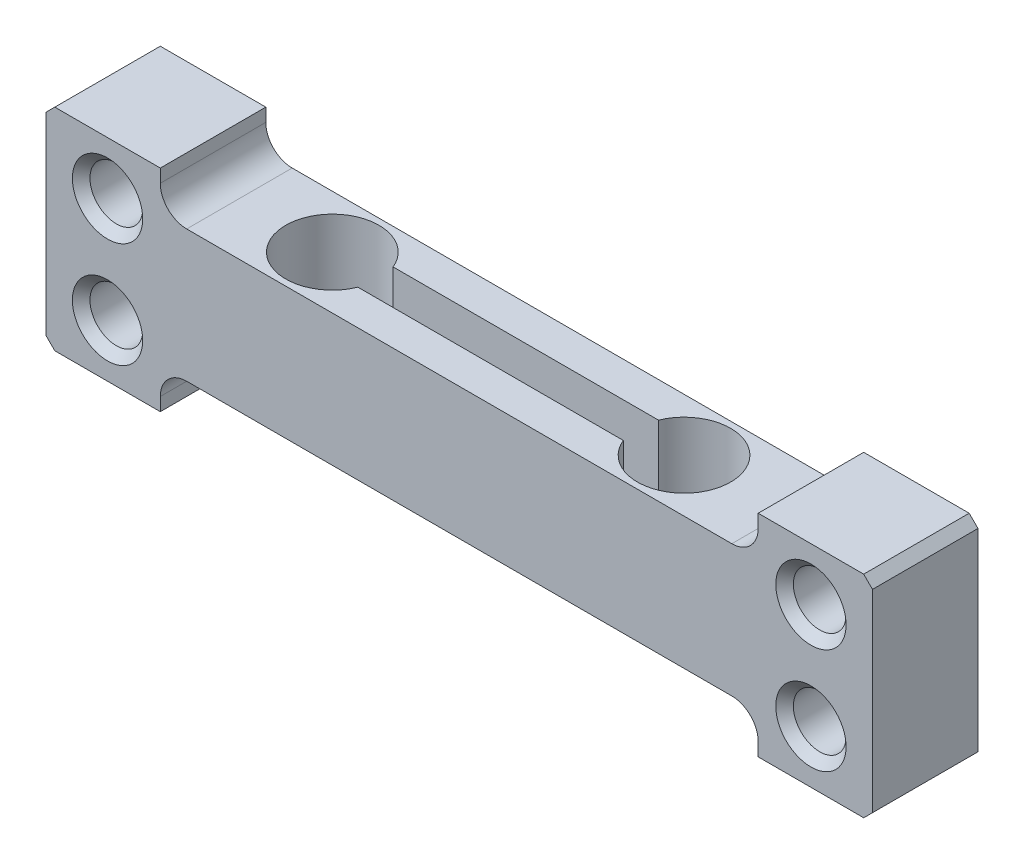
ISO-10303-21;
HEADER;
FILE_DESCRIPTION(('STEP AP214'),'2;1');
FILE_NAME('part.step','',(''),(''),'','','');
FILE_SCHEMA(('AUTOMOTIVE_DESIGN { 1 0 10303 214 1 1 1 1 }'));
ENDSEC;
DATA;
#1=APPLICATION_CONTEXT('core data for automotive mechanical design processes');
#2=APPLICATION_PROTOCOL_DEFINITION('international standard','automotive_design',2000,#1);
#3=PRODUCT_CONTEXT('',#1,'mechanical');
#4=PRODUCT('Part','Part','',(#3));
#5=PRODUCT_RELATED_PRODUCT_CATEGORY('part','',(#4));
#6=PRODUCT_DEFINITION_FORMATION('','',#4);
#7=PRODUCT_DEFINITION_CONTEXT('part definition',#1,'design');
#8=PRODUCT_DEFINITION('design','',#6,#7);
#9=PRODUCT_DEFINITION_SHAPE('','',#8);
#10=(LENGTH_UNIT() NAMED_UNIT(*) SI_UNIT(.MILLI.,.METRE.));
#11=(NAMED_UNIT(*) PLANE_ANGLE_UNIT() SI_UNIT($,.RADIAN.));
#12=(NAMED_UNIT(*) SI_UNIT($,.STERADIAN.) SOLID_ANGLE_UNIT());
#13=UNCERTAINTY_MEASURE_WITH_UNIT(LENGTH_MEASURE(1.E-05),#10,'distance_accuracy_value','');
#14=(GEOMETRIC_REPRESENTATION_CONTEXT(3) GLOBAL_UNCERTAINTY_ASSIGNED_CONTEXT((#13)) GLOBAL_UNIT_ASSIGNED_CONTEXT((#10,
#11,#12)) REPRESENTATION_CONTEXT('',''));
#15=CARTESIAN_POINT('',(0.,0.,0.));
#16=DIRECTION('',(0.,0.,1.));
#17=DIRECTION('',(1.,0.,0.));
#18=AXIS2_PLACEMENT_3D('',#15,#16,#17);
#19=CARTESIAN_POINT('',(8.,11.25,6.));
#20=DIRECTION('',(0.,0.,-1.));
#21=DIRECTION('',(-1.,0.,0.));
#22=AXIS2_PLACEMENT_3D('',#19,#20,#21);
#23=PLANE('',#22);
#24=CARTESIAN_POINT('',(3.5,3.,6.));
#25=DIRECTION('',(0.,0.,-1.));
#26=DIRECTION('',(-1.,0.,0.));
#27=AXIS2_PLACEMENT_3D('',#24,#25,#26);
#28=CIRCLE('',#27,2.00000000000001);
#29=CARTESIAN_POINT('',(1.49999999999999,3.,6.));
#30=VERTEX_POINT('',#29);
#31=EDGE_CURVE('E475',#30,#30,#28,.T.);
#32=ORIENTED_EDGE('',*,*,#31,.T.);
#33=EDGE_LOOP('',(#32));
#34=FACE_BOUND('',#33,.T.);
#35=CARTESIAN_POINT('',(3.5,9.,6.));
#36=DIRECTION('',(0.,0.,-1.));
#37=DIRECTION('',(-1.,0.,0.));
#38=AXIS2_PLACEMENT_3D('',#35,#36,#37);
#39=CIRCLE('',#38,2.00000000000001);
#40=CARTESIAN_POINT('',(1.49999999999999,9.,6.));
#41=VERTEX_POINT('',#40);
#42=EDGE_CURVE('E471',#41,#41,#39,.T.);
#43=ORIENTED_EDGE('',*,*,#42,.T.);
#44=EDGE_LOOP('',(#43));
#45=FACE_BOUND('',#44,.T.);
#46=CARTESIAN_POINT('',(43.5,9.,6.));
#47=DIRECTION('',(0.,0.,-1.));
#48=DIRECTION('',(-1.,0.,0.));
#49=AXIS2_PLACEMENT_3D('',#46,#47,#48);
#50=CIRCLE('',#49,2.00000000000001);
#51=CARTESIAN_POINT('',(41.5,9.,6.));
#52=VERTEX_POINT('',#51);
#53=EDGE_CURVE('E467',#52,#52,#50,.T.);
#54=ORIENTED_EDGE('',*,*,#53,.T.);
#55=EDGE_LOOP('',(#54));
#56=FACE_BOUND('',#55,.T.);
#57=CARTESIAN_POINT('',(43.5,3.,6.));
#58=DIRECTION('',(0.,0.,-1.));
#59=DIRECTION('',(-1.,0.,0.));
#60=AXIS2_PLACEMENT_3D('',#57,#58,#59);
#61=CIRCLE('',#60,2.00000000000001);
#62=CARTESIAN_POINT('',(41.5,3.,6.));
#63=VERTEX_POINT('',#62);
#64=EDGE_CURVE('E463',#63,#63,#61,.T.);
#65=ORIENTED_EDGE('',*,*,#64,.T.);
#66=EDGE_LOOP('',(#65));
#67=FACE_BOUND('',#66,.T.);
#68=DIRECTION('',(0.,-1.,0.));
#69=VECTOR('',#68,1.);
#70=CARTESIAN_POINT('',(0.,0.,6.));
#71=LINE('',#70,#69);
#72=CARTESIAN_POINT('',(0.,11.5,6.));
#73=VERTEX_POINT('',#72);
#74=CARTESIAN_POINT('',(0.,0.500000000000007,6.));
#75=VERTEX_POINT('',#74);
#76=EDGE_CURVE('E252',#73,#75,#71,.T.);
#77=ORIENTED_EDGE('',*,*,#76,.T.);
#78=DIRECTION('',(-0.707106781186548,0.707106781186548,0.));
#79=VECTOR('',#78,1.);
#80=CARTESIAN_POINT('',(0.500000000000007,0.,6.));
#81=LINE('',#80,#79);
#82=CARTESIAN_POINT('',(0.500000000000007,0.,6.));
#83=VERTEX_POINT('',#82);
#84=EDGE_CURVE('E435',#75,#83,#81,.F.);
#85=ORIENTED_EDGE('',*,*,#84,.T.);
#86=DIRECTION('',(1.,0.,0.));
#87=VECTOR('',#86,1.);
#88=CARTESIAN_POINT('',(0.,0.,6.));
#89=LINE('',#88,#87);
#90=CARTESIAN_POINT('',(6.5,0.,6.));
#91=VERTEX_POINT('',#90);
#92=EDGE_CURVE('E256',#83,#91,#89,.T.);
#93=ORIENTED_EDGE('',*,*,#92,.T.);
#94=DIRECTION('',(0.,1.,0.));
#95=VECTOR('',#94,1.);
#96=CARTESIAN_POINT('',(6.5,0.,6.));
#97=LINE('',#96,#95);
#98=CARTESIAN_POINT('',(6.5,0.749999999999989,6.));
#99=VERTEX_POINT('',#98);
#100=EDGE_CURVE('E260',#91,#99,#97,.T.);
#101=ORIENTED_EDGE('',*,*,#100,.T.);
#102=CARTESIAN_POINT('',(8.,0.75,6.));
#103=DIRECTION('',(0.,0.,-1.));
#104=DIRECTION('',(-1.,0.,0.));
#105=AXIS2_PLACEMENT_3D('',#102,#103,#104);
#106=CIRCLE('',#105,1.5);
#107=CARTESIAN_POINT('',(8.00000000000001,2.25,6.));
#108=VERTEX_POINT('',#107);
#109=EDGE_CURVE('E263',#99,#108,#106,.T.);
#110=ORIENTED_EDGE('',*,*,#109,.T.);
#111=DIRECTION('',(1.,0.,0.));
#112=VECTOR('',#111,1.);
#113=CARTESIAN_POINT('',(8.00000000000001,2.25,6.));
#114=LINE('',#113,#112);
#115=CARTESIAN_POINT('',(39.,2.25,6.));
#116=VERTEX_POINT('',#115);
#117=EDGE_CURVE('E266',#108,#116,#114,.T.);
#118=ORIENTED_EDGE('',*,*,#117,.T.);
#119=CARTESIAN_POINT('',(39.,0.75,6.));
#120=DIRECTION('',(0.,0.,-1.));
#121=DIRECTION('',(1.,0.,0.));
#122=AXIS2_PLACEMENT_3D('',#119,#120,#121);
#123=CIRCLE('',#122,1.5);
#124=CARTESIAN_POINT('',(40.5,0.749999999999989,6.));
#125=VERTEX_POINT('',#124);
#126=EDGE_CURVE('E269',#116,#125,#123,.T.);
#127=ORIENTED_EDGE('',*,*,#126,.T.);
#128=DIRECTION('',(0.,-1.,0.));
#129=VECTOR('',#128,1.);
#130=CARTESIAN_POINT('',(40.5,0.,6.));
#131=LINE('',#130,#129);
#132=CARTESIAN_POINT('',(40.5,0.,6.));
#133=VERTEX_POINT('',#132);
#134=EDGE_CURVE('E272',#125,#133,#131,.T.);
#135=ORIENTED_EDGE('',*,*,#134,.T.);
#136=DIRECTION('',(1.,0.,0.));
#137=VECTOR('',#136,1.);
#138=CARTESIAN_POINT('',(40.5,0.,6.));
#139=LINE('',#138,#137);
#140=CARTESIAN_POINT('',(46.5,0.,6.));
#141=VERTEX_POINT('',#140);
#142=EDGE_CURVE('E275',#133,#141,#139,.T.);
#143=ORIENTED_EDGE('',*,*,#142,.T.);
#144=DIRECTION('',(-0.707106781186548,-0.707106781186548,0.));
#145=VECTOR('',#144,1.);
#146=CARTESIAN_POINT('',(47.,0.500000000000007,6.));
#147=LINE('',#146,#145);
#148=CARTESIAN_POINT('',(47.,0.500000000000007,6.));
#149=VERTEX_POINT('',#148);
#150=EDGE_CURVE('E429',#141,#149,#147,.F.);
#151=ORIENTED_EDGE('',*,*,#150,.T.);
#152=DIRECTION('',(0.,1.,0.));
#153=VECTOR('',#152,1.);
#154=CARTESIAN_POINT('',(47.,0.,6.));
#155=LINE('',#154,#153);
#156=CARTESIAN_POINT('',(47.,11.5,6.));
#157=VERTEX_POINT('',#156);
#158=EDGE_CURVE('E279',#149,#157,#155,.T.);
#159=ORIENTED_EDGE('',*,*,#158,.T.);
#160=DIRECTION('',(0.707106781186552,-0.707106781186543,0.));
#161=VECTOR('',#160,1.);
#162=CARTESIAN_POINT('',(46.5,12.,6.));
#163=LINE('',#162,#161);
#164=CARTESIAN_POINT('',(46.5,12.,6.));
#165=VERTEX_POINT('',#164);
#166=EDGE_CURVE('E426',#157,#165,#163,.F.);
#167=ORIENTED_EDGE('',*,*,#166,.T.);
#168=DIRECTION('',(-1.,0.,0.));
#169=VECTOR('',#168,1.);
#170=CARTESIAN_POINT('',(40.5,12.,6.));
#171=LINE('',#170,#169);
#172=CARTESIAN_POINT('',(40.5,12.,6.));
#173=VERTEX_POINT('',#172);
#174=EDGE_CURVE('E283',#165,#173,#171,.T.);
#175=ORIENTED_EDGE('',*,*,#174,.T.);
#176=DIRECTION('',(0.,-1.,0.));
#177=VECTOR('',#176,1.);
#178=CARTESIAN_POINT('',(40.5,11.25,6.));
#179=LINE('',#178,#177);
#180=CARTESIAN_POINT('',(40.5,11.25,6.));
#181=VERTEX_POINT('',#180);
#182=EDGE_CURVE('E286',#173,#181,#179,.T.);
#183=ORIENTED_EDGE('',*,*,#182,.T.);
#184=CARTESIAN_POINT('',(39.,11.25,6.));
#185=DIRECTION('',(0.,0.,-1.));
#186=DIRECTION('',(-1.,0.,0.));
#187=AXIS2_PLACEMENT_3D('',#184,#185,#186);
#188=CIRCLE('',#187,1.5);
#189=CARTESIAN_POINT('',(39.,9.75,6.));
#190=VERTEX_POINT('',#189);
#191=EDGE_CURVE('E289',#181,#190,#188,.T.);
#192=ORIENTED_EDGE('',*,*,#191,.T.);
#193=DIRECTION('',(-1.,0.,0.));
#194=VECTOR('',#193,1.);
#195=CARTESIAN_POINT('',(8.00000000000001,9.75,6.));
#196=LINE('',#195,#194);
#197=CARTESIAN_POINT('',(8.00000000000001,9.75,6.));
#198=VERTEX_POINT('',#197);
#199=EDGE_CURVE('E292',#190,#198,#196,.T.);
#200=ORIENTED_EDGE('',*,*,#199,.T.);
#201=CARTESIAN_POINT('',(8.,11.25,6.));
#202=DIRECTION('',(0.,0.,-1.));
#203=DIRECTION('',(-1.,0.,0.));
#204=AXIS2_PLACEMENT_3D('',#201,#202,#203);
#205=CIRCLE('',#204,1.5);
#206=CARTESIAN_POINT('',(6.5,11.25,6.));
#207=VERTEX_POINT('',#206);
#208=EDGE_CURVE('E295',#198,#207,#205,.T.);
#209=ORIENTED_EDGE('',*,*,#208,.T.);
#210=DIRECTION('',(0.,1.,0.));
#211=VECTOR('',#210,1.);
#212=CARTESIAN_POINT('',(6.5,11.25,6.));
#213=LINE('',#212,#211);
#214=CARTESIAN_POINT('',(6.5,12.,6.));
#215=VERTEX_POINT('',#214);
#216=EDGE_CURVE('E298',#207,#215,#213,.T.);
#217=ORIENTED_EDGE('',*,*,#216,.T.);
#218=DIRECTION('',(-1.,0.,0.));
#219=VECTOR('',#218,1.);
#220=CARTESIAN_POINT('',(0.,12.,6.));
#221=LINE('',#220,#219);
#222=CARTESIAN_POINT('',(0.500000000000014,12.,6.));
#223=VERTEX_POINT('',#222);
#224=EDGE_CURVE('E301',#215,#223,#221,.T.);
#225=ORIENTED_EDGE('',*,*,#224,.T.);
#226=DIRECTION('',(0.707106781186548,0.707106781186548,0.));
#227=VECTOR('',#226,1.);
#228=CARTESIAN_POINT('',(0.,11.5,6.));
#229=LINE('',#228,#227);
#230=EDGE_CURVE('E432',#223,#73,#229,.F.);
#231=ORIENTED_EDGE('',*,*,#230,.T.);
#232=EDGE_LOOP('',(#77,#85,#93,#101,#110,#118,#127,#135,#143,#151,#159,#167,#175,#183,#192,#200,
#209,#217,#225,#231));
#233=FACE_BOUND('',#232,.T.);
#234=ADVANCED_FACE('F41',(#34,#45,#56,#67,#233),#23,.F.);
#235=CARTESIAN_POINT('',(8.,11.25,0.));
#236=DIRECTION('',(0.,0.,-1.));
#237=DIRECTION('',(-1.,0.,0.));
#238=AXIS2_PLACEMENT_3D('',#235,#236,#237);
#239=PLANE('',#238);
#240=CARTESIAN_POINT('',(3.5,3.,0.));
#241=DIRECTION('',(0.,0.,-1.));
#242=DIRECTION('',(-1.,0.,0.));
#243=AXIS2_PLACEMENT_3D('',#240,#241,#242);
#244=CIRCLE('',#243,2.00000000000002);
#245=CARTESIAN_POINT('',(1.49999999999998,3.,0.));
#246=VERTEX_POINT('',#245);
#247=EDGE_CURVE('E499',#246,#246,#244,.F.);
#248=ORIENTED_EDGE('',*,*,#247,.T.);
#249=EDGE_LOOP('',(#248));
#250=FACE_BOUND('',#249,.T.);
#251=CARTESIAN_POINT('',(3.5,9.,0.));
#252=DIRECTION('',(0.,0.,-1.));
#253=DIRECTION('',(-1.,0.,0.));
#254=AXIS2_PLACEMENT_3D('',#251,#252,#253);
#255=CIRCLE('',#254,2.00000000000002);
#256=CARTESIAN_POINT('',(1.49999999999998,9.,0.));
#257=VERTEX_POINT('',#256);
#258=EDGE_CURVE('E495',#257,#257,#255,.F.);
#259=ORIENTED_EDGE('',*,*,#258,.T.);
#260=EDGE_LOOP('',(#259));
#261=FACE_BOUND('',#260,.T.);
#262=CARTESIAN_POINT('',(43.5,3.,0.));
#263=DIRECTION('',(0.,0.,-1.));
#264=DIRECTION('',(-1.,0.,0.));
#265=AXIS2_PLACEMENT_3D('',#262,#263,#264);
#266=CIRCLE('',#265,2.);
#267=CARTESIAN_POINT('',(41.5,3.,0.));
#268=VERTEX_POINT('',#267);
#269=EDGE_CURVE('E491',#268,#268,#266,.F.);
#270=ORIENTED_EDGE('',*,*,#269,.T.);
#271=EDGE_LOOP('',(#270));
#272=FACE_BOUND('',#271,.T.);
#273=CARTESIAN_POINT('',(43.5,9.,0.));
#274=DIRECTION('',(0.,0.,-1.));
#275=DIRECTION('',(-1.,0.,0.));
#276=AXIS2_PLACEMENT_3D('',#273,#274,#275);
#277=CIRCLE('',#276,2.);
#278=CARTESIAN_POINT('',(41.5,9.,0.));
#279=VERTEX_POINT('',#278);
#280=EDGE_CURVE('E487',#279,#279,#277,.F.);
#281=ORIENTED_EDGE('',*,*,#280,.T.);
#282=EDGE_LOOP('',(#281));
#283=FACE_BOUND('',#282,.T.);
#284=DIRECTION('',(1.,0.,0.));
#285=VECTOR('',#284,1.);
#286=CARTESIAN_POINT('',(0.,0.,0.));
#287=LINE('',#286,#285);
#288=CARTESIAN_POINT('',(0.500000000000007,0.,0.));
#289=VERTEX_POINT('',#288);
#290=CARTESIAN_POINT('',(6.5,0.,0.));
#291=VERTEX_POINT('',#290);
#292=EDGE_CURVE('E309',#289,#291,#287,.T.);
#293=ORIENTED_EDGE('',*,*,#292,.F.);
#294=DIRECTION('',(0.707106781186548,-0.707106781186548,0.));
#295=VECTOR('',#294,1.);
#296=CARTESIAN_POINT('',(-1.375,1.875,0.));
#297=LINE('',#296,#295);
#298=CARTESIAN_POINT('',(0.,0.500000000000007,0.));
#299=VERTEX_POINT('',#298);
#300=EDGE_CURVE('E416',#289,#299,#297,.F.);
#301=ORIENTED_EDGE('',*,*,#300,.T.);
#302=DIRECTION('',(0.,-1.,0.));
#303=VECTOR('',#302,1.);
#304=CARTESIAN_POINT('',(0.,0.,0.));
#305=LINE('',#304,#303);
#306=CARTESIAN_POINT('',(0.,11.5,0.));
#307=VERTEX_POINT('',#306);
#308=EDGE_CURVE('E251',#307,#299,#305,.T.);
#309=ORIENTED_EDGE('',*,*,#308,.F.);
#310=DIRECTION('',(-0.707106781186548,-0.707106781186548,0.));
#311=VECTOR('',#310,1.);
#312=CARTESIAN_POINT('',(3.87500000000001,15.375,0.));
#313=LINE('',#312,#311);
#314=CARTESIAN_POINT('',(0.500000000000014,12.,0.));
#315=VERTEX_POINT('',#314);
#316=EDGE_CURVE('E413',#307,#315,#313,.F.);
#317=ORIENTED_EDGE('',*,*,#316,.T.);
#318=DIRECTION('',(-1.,0.,0.));
#319=VECTOR('',#318,1.);
#320=CARTESIAN_POINT('',(0.,12.,0.));
#321=LINE('',#320,#319);
#322=CARTESIAN_POINT('',(6.5,12.,0.));
#323=VERTEX_POINT('',#322);
#324=EDGE_CURVE('E257',#323,#315,#321,.T.);
#325=ORIENTED_EDGE('',*,*,#324,.F.);
#326=DIRECTION('',(0.,1.,0.));
#327=VECTOR('',#326,1.);
#328=CARTESIAN_POINT('',(6.5,11.25,0.));
#329=LINE('',#328,#327);
#330=CARTESIAN_POINT('',(6.5,11.25,0.));
#331=VERTEX_POINT('',#330);
#332=EDGE_CURVE('E350',#331,#323,#329,.T.);
#333=ORIENTED_EDGE('',*,*,#332,.F.);
#334=CARTESIAN_POINT('',(8.,11.25,0.));
#335=DIRECTION('',(0.,0.,-1.));
#336=DIRECTION('',(-1.,0.,0.));
#337=AXIS2_PLACEMENT_3D('',#334,#335,#336);
#338=CIRCLE('',#337,1.5);
#339=CARTESIAN_POINT('',(8.00000000000001,9.75,0.));
#340=VERTEX_POINT('',#339);
#341=EDGE_CURVE('E347',#340,#331,#338,.T.);
#342=ORIENTED_EDGE('',*,*,#341,.F.);
#343=DIRECTION('',(-1.,0.,0.));
#344=VECTOR('',#343,1.);
#345=CARTESIAN_POINT('',(8.00000000000001,9.75,0.));
#346=LINE('',#345,#344);
#347=CARTESIAN_POINT('',(39.,9.75,0.));
#348=VERTEX_POINT('',#347);
#349=EDGE_CURVE('E344',#348,#340,#346,.T.);
#350=ORIENTED_EDGE('',*,*,#349,.F.);
#351=CARTESIAN_POINT('',(39.,11.25,0.));
#352=DIRECTION('',(0.,0.,-1.));
#353=DIRECTION('',(-1.,0.,0.));
#354=AXIS2_PLACEMENT_3D('',#351,#352,#353);
#355=CIRCLE('',#354,1.5);
#356=CARTESIAN_POINT('',(40.5,11.25,0.));
#357=VERTEX_POINT('',#356);
#358=EDGE_CURVE('E341',#357,#348,#355,.T.);
#359=ORIENTED_EDGE('',*,*,#358,.F.);
#360=DIRECTION('',(0.,-1.,0.));
#361=VECTOR('',#360,1.);
#362=CARTESIAN_POINT('',(40.5,11.25,0.));
#363=LINE('',#362,#361);
#364=CARTESIAN_POINT('',(40.5,12.,0.));
#365=VERTEX_POINT('',#364);
#366=EDGE_CURVE('E338',#365,#357,#363,.T.);
#367=ORIENTED_EDGE('',*,*,#366,.F.);
#368=DIRECTION('',(-1.,0.,0.));
#369=VECTOR('',#368,1.);
#370=CARTESIAN_POINT('',(40.5,12.,0.));
#371=LINE('',#370,#369);
#372=CARTESIAN_POINT('',(46.5,12.,0.));
#373=VERTEX_POINT('',#372);
#374=EDGE_CURVE('E335',#373,#365,#371,.T.);
#375=ORIENTED_EDGE('',*,*,#374,.F.);
#376=DIRECTION('',(-0.707106781186552,0.707106781186543,0.));
#377=VECTOR('',#376,1.);
#378=CARTESIAN_POINT('',(27.6249999999997,30.875,0.));
#379=LINE('',#378,#377);
#380=CARTESIAN_POINT('',(47.,11.5,0.));
#381=VERTEX_POINT('',#380);
#382=EDGE_CURVE('E407',#373,#381,#379,.F.);
#383=ORIENTED_EDGE('',*,*,#382,.T.);
#384=DIRECTION('',(0.,1.,0.));
#385=VECTOR('',#384,1.);
#386=CARTESIAN_POINT('',(47.,0.,0.));
#387=LINE('',#386,#385);
#388=CARTESIAN_POINT('',(47.,0.500000000000007,0.));
#389=VERTEX_POINT('',#388);
#390=EDGE_CURVE('E331',#389,#381,#387,.T.);
#391=ORIENTED_EDGE('',*,*,#390,.F.);
#392=DIRECTION('',(0.707106781186548,0.707106781186548,0.));
#393=VECTOR('',#392,1.);
#394=CARTESIAN_POINT('',(32.875,-13.625,0.));
#395=LINE('',#394,#393);
#396=CARTESIAN_POINT('',(46.5,0.,0.));
#397=VERTEX_POINT('',#396);
#398=EDGE_CURVE('E410',#389,#397,#395,.F.);
#399=ORIENTED_EDGE('',*,*,#398,.T.);
#400=DIRECTION('',(1.,0.,0.));
#401=VECTOR('',#400,1.);
#402=CARTESIAN_POINT('',(40.5,0.,0.));
#403=LINE('',#402,#401);
#404=CARTESIAN_POINT('',(40.5,0.,0.));
#405=VERTEX_POINT('',#404);
#406=EDGE_CURVE('E327',#405,#397,#403,.T.);
#407=ORIENTED_EDGE('',*,*,#406,.F.);
#408=DIRECTION('',(0.,-1.,0.));
#409=VECTOR('',#408,1.);
#410=CARTESIAN_POINT('',(40.5,0.,0.));
#411=LINE('',#410,#409);
#412=CARTESIAN_POINT('',(40.5,0.749999999999989,0.));
#413=VERTEX_POINT('',#412);
#414=EDGE_CURVE('E324',#413,#405,#411,.T.);
#415=ORIENTED_EDGE('',*,*,#414,.F.);
#416=CARTESIAN_POINT('',(39.,0.75,0.));
#417=DIRECTION('',(0.,0.,-1.));
#418=DIRECTION('',(1.,0.,0.));
#419=AXIS2_PLACEMENT_3D('',#416,#417,#418);
#420=CIRCLE('',#419,1.5);
#421=CARTESIAN_POINT('',(39.,2.25,0.));
#422=VERTEX_POINT('',#421);
#423=EDGE_CURVE('E321',#422,#413,#420,.T.);
#424=ORIENTED_EDGE('',*,*,#423,.F.);
#425=DIRECTION('',(1.,0.,0.));
#426=VECTOR('',#425,1.);
#427=CARTESIAN_POINT('',(8.00000000000001,2.25,0.));
#428=LINE('',#427,#426);
#429=CARTESIAN_POINT('',(8.00000000000001,2.25,0.));
#430=VERTEX_POINT('',#429);
#431=EDGE_CURVE('E318',#430,#422,#428,.T.);
#432=ORIENTED_EDGE('',*,*,#431,.F.);
#433=CARTESIAN_POINT('',(8.,0.75,0.));
#434=DIRECTION('',(0.,0.,-1.));
#435=DIRECTION('',(-1.,0.,0.));
#436=AXIS2_PLACEMENT_3D('',#433,#434,#435);
#437=CIRCLE('',#436,1.5);
#438=CARTESIAN_POINT('',(6.5,0.749999999999989,0.));
#439=VERTEX_POINT('',#438);
#440=EDGE_CURVE('E315',#439,#430,#437,.T.);
#441=ORIENTED_EDGE('',*,*,#440,.F.);
#442=DIRECTION('',(0.,1.,0.));
#443=VECTOR('',#442,1.);
#444=CARTESIAN_POINT('',(6.5,0.,0.));
#445=LINE('',#444,#443);
#446=EDGE_CURVE('E312',#291,#439,#445,.T.);
#447=ORIENTED_EDGE('',*,*,#446,.F.);
#448=EDGE_LOOP('',(#293,#301,#309,#317,#325,#333,#342,#350,#359,#367,#375,#383,#391,#399,#407,
#415,#424,#432,#441,#447));
#449=FACE_BOUND('',#448,.T.);
#450=ADVANCED_FACE('F530',(#250,#261,#272,#283,#449),#239,.T.);
#451=CARTESIAN_POINT('',(0.,0.,6.));
#452=DIRECTION('',(1.,0.,0.));
#453=DIRECTION('',(0.,0.,-1.));
#454=AXIS2_PLACEMENT_3D('',#451,#452,#453);
#455=PLANE('',#454);
#456=ORIENTED_EDGE('',*,*,#308,.T.);
#457=DIRECTION('',(0.,0.,1.));
#458=VECTOR('',#457,1.);
#459=CARTESIAN_POINT('',(0.,0.500000000000007,6.));
#460=LINE('',#459,#458);
#461=EDGE_CURVE('E423',#299,#75,#460,.T.);
#462=ORIENTED_EDGE('',*,*,#461,.T.);
#463=ORIENTED_EDGE('',*,*,#76,.F.);
#464=DIRECTION('',(0.,0.,-1.));
#465=VECTOR('',#464,1.);
#466=CARTESIAN_POINT('',(0.,11.5,6.));
#467=LINE('',#466,#465);
#468=EDGE_CURVE('E419',#73,#307,#467,.T.);
#469=ORIENTED_EDGE('',*,*,#468,.T.);
#470=EDGE_LOOP('',(#456,#462,#463,#469));
#471=FACE_BOUND('',#470,.T.);
#472=ADVANCED_FACE('F536',(#471),#455,.F.);
#473=CARTESIAN_POINT('',(0.,0.,6.));
#474=DIRECTION('',(0.,1.,0.));
#475=DIRECTION('',(0.,0.,1.));
#476=AXIS2_PLACEMENT_3D('',#473,#474,#475);
#477=PLANE('',#476);
#478=ORIENTED_EDGE('',*,*,#92,.F.);
#479=DIRECTION('',(0.,0.,-1.));
#480=VECTOR('',#479,1.);
#481=CARTESIAN_POINT('',(0.500000000000007,0.,6.));
#482=LINE('',#481,#480);
#483=EDGE_CURVE('E403',#83,#289,#482,.T.);
#484=ORIENTED_EDGE('',*,*,#483,.T.);
#485=ORIENTED_EDGE('',*,*,#292,.T.);
#486=DIRECTION('',(0.,0.,-1.));
#487=VECTOR('',#486,1.);
#488=CARTESIAN_POINT('',(6.5,0.,6.));
#489=LINE('',#488,#487);
#490=EDGE_CURVE('E399',#91,#291,#489,.T.);
#491=ORIENTED_EDGE('',*,*,#490,.F.);
#492=EDGE_LOOP('',(#478,#484,#485,#491));
#493=FACE_BOUND('',#492,.T.);
#494=ADVANCED_FACE('F597',(#493),#477,.F.);
#495=CARTESIAN_POINT('',(6.5,0.,6.));
#496=DIRECTION('',(-1.,0.,0.));
#497=DIRECTION('',(0.,0.,1.));
#498=AXIS2_PLACEMENT_3D('',#495,#496,#497);
#499=PLANE('',#498);
#500=ORIENTED_EDGE('',*,*,#446,.T.);
#501=DIRECTION('',(0.,0.,-1.));
#502=VECTOR('',#501,1.);
#503=CARTESIAN_POINT('',(6.5,0.749999999999989,6.));
#504=LINE('',#503,#502);
#505=EDGE_CURVE('E395',#99,#439,#504,.T.);
#506=ORIENTED_EDGE('',*,*,#505,.F.);
#507=ORIENTED_EDGE('',*,*,#100,.F.);
#508=ORIENTED_EDGE('',*,*,#490,.T.);
#509=EDGE_LOOP('',(#500,#506,#507,#508));
#510=FACE_BOUND('',#509,.T.);
#511=ADVANCED_FACE('F593',(#510),#499,.F.);
#512=CARTESIAN_POINT('',(8.,0.75,6.));
#513=DIRECTION('',(0.,0.,-1.));
#514=DIRECTION('',(-1.,0.,0.));
#515=AXIS2_PLACEMENT_3D('',#512,#513,#514);
#516=CYLINDRICAL_SURFACE('',#515,1.5);
#517=ORIENTED_EDGE('',*,*,#440,.T.);
#518=DIRECTION('',(0.,0.,-1.));
#519=VECTOR('',#518,1.);
#520=CARTESIAN_POINT('',(8.00000000000001,2.25,6.));
#521=LINE('',#520,#519);
#522=EDGE_CURVE('E391',#108,#430,#521,.T.);
#523=ORIENTED_EDGE('',*,*,#522,.F.);
#524=ORIENTED_EDGE('',*,*,#109,.F.);
#525=ORIENTED_EDGE('',*,*,#505,.T.);
#526=EDGE_LOOP('',(#517,#523,#524,#525));
#527=FACE_BOUND('',#526,.T.);
#528=ADVANCED_FACE('F589',(#527),#516,.F.);
#529=CARTESIAN_POINT('',(8.00000000000001,2.25,6.));
#530=DIRECTION('',(0.,1.,0.));
#531=DIRECTION('',(0.,0.,1.));
#532=AXIS2_PLACEMENT_3D('',#529,#530,#531);
#533=PLANE('',#532);
#534=DIRECTION('',(-1.,0.,0.));
#535=VECTOR('',#534,1.);
#536=CARTESIAN_POINT('',(8.00000000000001,2.25,2.));
#537=LINE('',#536,#535);
#538=CARTESIAN_POINT('',(30.8294724686745,2.25,2.));
#539=VERTEX_POINT('',#538);
#540=CARTESIAN_POINT('',(15.7376289453977,2.25,2.));
#541=VERTEX_POINT('',#540);
#542=EDGE_CURVE('E243',#539,#541,#537,.T.);
#543=ORIENTED_EDGE('',*,*,#542,.T.);
#544=CARTESIAN_POINT('',(13.2835507070361,2.25,3.));
#545=DIRECTION('',(0.,1.,0.));
#546=DIRECTION('',(0.,0.,1.));
#547=AXIS2_PLACEMENT_3D('',#544,#545,#546);
#548=CIRCLE('',#547,2.65);
#549=CARTESIAN_POINT('',(15.7376289453977,2.25,4.));
#550=VERTEX_POINT('',#549);
#551=EDGE_CURVE('E247',#541,#550,#548,.T.);
#552=ORIENTED_EDGE('',*,*,#551,.T.);
#553=DIRECTION('',(1.,0.,0.));
#554=VECTOR('',#553,1.);
#555=CARTESIAN_POINT('',(8.00000000000001,2.25,4.));
#556=LINE('',#555,#554);
#557=CARTESIAN_POINT('',(30.8294724686745,2.25,4.));
#558=VERTEX_POINT('',#557);
#559=EDGE_CURVE('E234',#550,#558,#556,.T.);
#560=ORIENTED_EDGE('',*,*,#559,.T.);
#561=CARTESIAN_POINT('',(33.2835507070361,2.25,3.));
#562=DIRECTION('',(0.,1.,0.));
#563=DIRECTION('',(0.,0.,1.));
#564=AXIS2_PLACEMENT_3D('',#561,#562,#563);
#565=CIRCLE('',#564,2.65);
#566=EDGE_CURVE('E209',#558,#539,#565,.T.);
#567=ORIENTED_EDGE('',*,*,#566,.T.);
#568=EDGE_LOOP('',(#543,#552,#560,#567));
#569=FACE_BOUND('',#568,.T.);
#570=ORIENTED_EDGE('',*,*,#431,.T.);
#571=DIRECTION('',(0.,0.,-1.));
#572=VECTOR('',#571,1.);
#573=CARTESIAN_POINT('',(39.,2.25,6.));
#574=LINE('',#573,#572);
#575=EDGE_CURVE('E387',#116,#422,#574,.T.);
#576=ORIENTED_EDGE('',*,*,#575,.F.);
#577=ORIENTED_EDGE('',*,*,#117,.F.);
#578=ORIENTED_EDGE('',*,*,#522,.T.);
#579=EDGE_LOOP('',(#570,#576,#577,#578));
#580=FACE_BOUND('',#579,.T.);
#581=ADVANCED_FACE('F585',(#569,#580),#533,.F.);
#582=CARTESIAN_POINT('',(39.,0.75,6.));
#583=DIRECTION('',(0.,0.,-1.));
#584=DIRECTION('',(-1.,0.,0.));
#585=AXIS2_PLACEMENT_3D('',#582,#583,#584);
#586=CYLINDRICAL_SURFACE('',#585,1.5);
#587=ORIENTED_EDGE('',*,*,#423,.T.);
#588=DIRECTION('',(0.,0.,-1.));
#589=VECTOR('',#588,1.);
#590=CARTESIAN_POINT('',(40.5,0.749999999999989,6.));
#591=LINE('',#590,#589);
#592=EDGE_CURVE('E383',#125,#413,#591,.T.);
#593=ORIENTED_EDGE('',*,*,#592,.F.);
#594=ORIENTED_EDGE('',*,*,#126,.F.);
#595=ORIENTED_EDGE('',*,*,#575,.T.);
#596=EDGE_LOOP('',(#587,#593,#594,#595));
#597=FACE_BOUND('',#596,.T.);
#598=ADVANCED_FACE('F581',(#597),#586,.F.);
#599=CARTESIAN_POINT('',(40.5,0.,6.));
#600=DIRECTION('',(1.,0.,0.));
#601=DIRECTION('',(0.,0.,-1.));
#602=AXIS2_PLACEMENT_3D('',#599,#600,#601);
#603=PLANE('',#602);
#604=ORIENTED_EDGE('',*,*,#414,.T.);
#605=DIRECTION('',(0.,0.,-1.));
#606=VECTOR('',#605,1.);
#607=CARTESIAN_POINT('',(40.5,0.,6.));
#608=LINE('',#607,#606);
#609=EDGE_CURVE('E379',#133,#405,#608,.T.);
#610=ORIENTED_EDGE('',*,*,#609,.F.);
#611=ORIENTED_EDGE('',*,*,#134,.F.);
#612=ORIENTED_EDGE('',*,*,#592,.T.);
#613=EDGE_LOOP('',(#604,#610,#611,#612));
#614=FACE_BOUND('',#613,.T.);
#615=ADVANCED_FACE('F577',(#614),#603,.F.);
#616=CARTESIAN_POINT('',(40.5,0.,6.));
#617=DIRECTION('',(0.,1.,0.));
#618=DIRECTION('',(0.,0.,1.));
#619=AXIS2_PLACEMENT_3D('',#616,#617,#618);
#620=PLANE('',#619);
#621=ORIENTED_EDGE('',*,*,#406,.T.);
#622=DIRECTION('',(0.,0.,1.));
#623=VECTOR('',#622,1.);
#624=CARTESIAN_POINT('',(46.5,0.,6.));
#625=LINE('',#624,#623);
#626=EDGE_CURVE('E448',#397,#141,#625,.T.);
#627=ORIENTED_EDGE('',*,*,#626,.T.);
#628=ORIENTED_EDGE('',*,*,#142,.F.);
#629=ORIENTED_EDGE('',*,*,#609,.T.);
#630=EDGE_LOOP('',(#621,#627,#628,#629));
#631=FACE_BOUND('',#630,.T.);
#632=ADVANCED_FACE('F573',(#631),#620,.F.);
#633=CARTESIAN_POINT('',(47.,0.,6.));
#634=DIRECTION('',(-1.,0.,0.));
#635=DIRECTION('',(0.,0.,1.));
#636=AXIS2_PLACEMENT_3D('',#633,#634,#635);
#637=PLANE('',#636);
#638=ORIENTED_EDGE('',*,*,#158,.F.);
#639=DIRECTION('',(0.,0.,-1.));
#640=VECTOR('',#639,1.);
#641=CARTESIAN_POINT('',(47.,0.500000000000007,6.));
#642=LINE('',#641,#640);
#643=EDGE_CURVE('E444',#149,#389,#642,.T.);
#644=ORIENTED_EDGE('',*,*,#643,.T.);
#645=ORIENTED_EDGE('',*,*,#390,.T.);
#646=DIRECTION('',(0.,0.,1.));
#647=VECTOR('',#646,1.);
#648=CARTESIAN_POINT('',(47.,11.5,6.));
#649=LINE('',#648,#647);
#650=EDGE_CURVE('E441',#381,#157,#649,.T.);
#651=ORIENTED_EDGE('',*,*,#650,.T.);
#652=EDGE_LOOP('',(#638,#644,#645,#651));
#653=FACE_BOUND('',#652,.T.);
#654=ADVANCED_FACE('F569',(#653),#637,.F.);
#655=CARTESIAN_POINT('',(40.5,12.,6.));
#656=DIRECTION('',(0.,-1.,0.));
#657=DIRECTION('',(0.,0.,-1.));
#658=AXIS2_PLACEMENT_3D('',#655,#656,#657);
#659=PLANE('',#658);
#660=ORIENTED_EDGE('',*,*,#174,.F.);
#661=DIRECTION('',(0.,0.,-1.));
#662=VECTOR('',#661,1.);
#663=CARTESIAN_POINT('',(46.5,12.,6.));
#664=LINE('',#663,#662);
#665=EDGE_CURVE('E451',#165,#373,#664,.T.);
#666=ORIENTED_EDGE('',*,*,#665,.T.);
#667=ORIENTED_EDGE('',*,*,#374,.T.);
#668=DIRECTION('',(0.,0.,-1.));
#669=VECTOR('',#668,1.);
#670=CARTESIAN_POINT('',(40.5,12.,6.));
#671=LINE('',#670,#669);
#672=EDGE_CURVE('E375',#173,#365,#671,.T.);
#673=ORIENTED_EDGE('',*,*,#672,.F.);
#674=EDGE_LOOP('',(#660,#666,#667,#673));
#675=FACE_BOUND('',#674,.T.);
#676=ADVANCED_FACE('F565',(#675),#659,.F.);
#677=CARTESIAN_POINT('',(40.5,11.25,6.));
#678=DIRECTION('',(1.,0.,0.));
#679=DIRECTION('',(0.,0.,-1.));
#680=AXIS2_PLACEMENT_3D('',#677,#678,#679);
#681=PLANE('',#680);
#682=ORIENTED_EDGE('',*,*,#366,.T.);
#683=DIRECTION('',(0.,0.,-1.));
#684=VECTOR('',#683,1.);
#685=CARTESIAN_POINT('',(40.5,11.25,6.));
#686=LINE('',#685,#684);
#687=EDGE_CURVE('E371',#181,#357,#686,.T.);
#688=ORIENTED_EDGE('',*,*,#687,.F.);
#689=ORIENTED_EDGE('',*,*,#182,.F.);
#690=ORIENTED_EDGE('',*,*,#672,.T.);
#691=EDGE_LOOP('',(#682,#688,#689,#690));
#692=FACE_BOUND('',#691,.T.);
#693=ADVANCED_FACE('F561',(#692),#681,.F.);
#694=CARTESIAN_POINT('',(39.,11.25,6.));
#695=DIRECTION('',(0.,0.,-1.));
#696=DIRECTION('',(-1.,0.,0.));
#697=AXIS2_PLACEMENT_3D('',#694,#695,#696);
#698=CYLINDRICAL_SURFACE('',#697,1.5);
#699=ORIENTED_EDGE('',*,*,#358,.T.);
#700=DIRECTION('',(0.,0.,-1.));
#701=VECTOR('',#700,1.);
#702=CARTESIAN_POINT('',(39.,9.75,6.));
#703=LINE('',#702,#701);
#704=EDGE_CURVE('E367',#190,#348,#703,.T.);
#705=ORIENTED_EDGE('',*,*,#704,.F.);
#706=ORIENTED_EDGE('',*,*,#191,.F.);
#707=ORIENTED_EDGE('',*,*,#687,.T.);
#708=EDGE_LOOP('',(#699,#705,#706,#707));
#709=FACE_BOUND('',#708,.T.);
#710=ADVANCED_FACE('F558',(#709),#698,.F.);
#711=CARTESIAN_POINT('',(8.00000000000001,9.75,6.));
#712=DIRECTION('',(0.,-1.,0.));
#713=DIRECTION('',(0.,0.,-1.));
#714=AXIS2_PLACEMENT_3D('',#711,#712,#713);
#715=PLANE('',#714);
#716=DIRECTION('',(1.,0.,0.));
#717=VECTOR('',#716,1.);
#718=CARTESIAN_POINT('',(30.8294724686745,9.75,4.));
#719=LINE('',#718,#717);
#720=CARTESIAN_POINT('',(15.7376289453977,9.75,4.));
#721=VERTEX_POINT('',#720);
#722=CARTESIAN_POINT('',(30.8294724686745,9.75,4.));
#723=VERTEX_POINT('',#722);
#724=EDGE_CURVE('E216',#721,#723,#719,.T.);
#725=ORIENTED_EDGE('',*,*,#724,.F.);
#726=CARTESIAN_POINT('',(13.2835507070361,9.75,3.));
#727=DIRECTION('',(0.,1.,0.));
#728=DIRECTION('',(0.,0.,1.));
#729=AXIS2_PLACEMENT_3D('',#726,#727,#728);
#730=CIRCLE('',#729,2.65);
#731=CARTESIAN_POINT('',(15.7376289453977,9.75,2.));
#732=VERTEX_POINT('',#731);
#733=EDGE_CURVE('E65',#732,#721,#730,.T.);
#734=ORIENTED_EDGE('',*,*,#733,.F.);
#735=DIRECTION('',(-1.,0.,0.));
#736=VECTOR('',#735,1.);
#737=CARTESIAN_POINT('',(30.8294724686745,9.75,2.));
#738=LINE('',#737,#736);
#739=CARTESIAN_POINT('',(30.8294724686745,9.75,2.));
#740=VERTEX_POINT('',#739);
#741=EDGE_CURVE('E224',#740,#732,#738,.T.);
#742=ORIENTED_EDGE('',*,*,#741,.F.);
#743=CARTESIAN_POINT('',(33.2835507070361,9.75,3.));
#744=DIRECTION('',(0.,1.,0.));
#745=DIRECTION('',(0.,0.,1.));
#746=AXIS2_PLACEMENT_3D('',#743,#744,#745);
#747=CIRCLE('',#746,2.65);
#748=EDGE_CURVE('E206',#723,#740,#747,.T.);
#749=ORIENTED_EDGE('',*,*,#748,.F.);
#750=EDGE_LOOP('',(#725,#734,#742,#749));
#751=FACE_BOUND('',#750,.T.);
#752=ORIENTED_EDGE('',*,*,#349,.T.);
#753=DIRECTION('',(0.,0.,-1.));
#754=VECTOR('',#753,1.);
#755=CARTESIAN_POINT('',(8.00000000000001,9.75,6.));
#756=LINE('',#755,#754);
#757=EDGE_CURVE('E363',#198,#340,#756,.T.);
#758=ORIENTED_EDGE('',*,*,#757,.F.);
#759=ORIENTED_EDGE('',*,*,#199,.F.);
#760=ORIENTED_EDGE('',*,*,#704,.T.);
#761=EDGE_LOOP('',(#752,#758,#759,#760));
#762=FACE_BOUND('',#761,.T.);
#763=ADVANCED_FACE('F221',(#751,#762),#715,.F.);
#764=CARTESIAN_POINT('',(8.,11.25,6.));
#765=DIRECTION('',(0.,0.,-1.));
#766=DIRECTION('',(-1.,0.,0.));
#767=AXIS2_PLACEMENT_3D('',#764,#765,#766);
#768=CYLINDRICAL_SURFACE('',#767,1.5);
#769=ORIENTED_EDGE('',*,*,#341,.T.);
#770=DIRECTION('',(0.,0.,-1.));
#771=VECTOR('',#770,1.);
#772=CARTESIAN_POINT('',(6.5,11.25,6.));
#773=LINE('',#772,#771);
#774=EDGE_CURVE('E359',#207,#331,#773,.T.);
#775=ORIENTED_EDGE('',*,*,#774,.F.);
#776=ORIENTED_EDGE('',*,*,#208,.F.);
#777=ORIENTED_EDGE('',*,*,#757,.T.);
#778=EDGE_LOOP('',(#769,#775,#776,#777));
#779=FACE_BOUND('',#778,.T.);
#780=ADVANCED_FACE('F551',(#779),#768,.F.);
#781=CARTESIAN_POINT('',(6.5,11.25,6.));
#782=DIRECTION('',(-1.,0.,0.));
#783=DIRECTION('',(0.,0.,1.));
#784=AXIS2_PLACEMENT_3D('',#781,#782,#783);
#785=PLANE('',#784);
#786=ORIENTED_EDGE('',*,*,#332,.T.);
#787=DIRECTION('',(0.,0.,-1.));
#788=VECTOR('',#787,1.);
#789=CARTESIAN_POINT('',(6.5,12.,6.));
#790=LINE('',#789,#788);
#791=EDGE_CURVE('E305',#215,#323,#790,.T.);
#792=ORIENTED_EDGE('',*,*,#791,.F.);
#793=ORIENTED_EDGE('',*,*,#216,.F.);
#794=ORIENTED_EDGE('',*,*,#774,.T.);
#795=EDGE_LOOP('',(#786,#792,#793,#794));
#796=FACE_BOUND('',#795,.T.);
#797=ADVANCED_FACE('F547',(#796),#785,.F.);
#798=CARTESIAN_POINT('',(0.,12.,6.));
#799=DIRECTION('',(0.,-1.,0.));
#800=DIRECTION('',(0.,0.,-1.));
#801=AXIS2_PLACEMENT_3D('',#798,#799,#800);
#802=PLANE('',#801);
#803=ORIENTED_EDGE('',*,*,#324,.T.);
#804=DIRECTION('',(0.,0.,1.));
#805=VECTOR('',#804,1.);
#806=CARTESIAN_POINT('',(0.500000000000014,12.,6.));
#807=LINE('',#806,#805);
#808=EDGE_CURVE('E438',#315,#223,#807,.T.);
#809=ORIENTED_EDGE('',*,*,#808,.T.);
#810=ORIENTED_EDGE('',*,*,#224,.F.);
#811=ORIENTED_EDGE('',*,*,#791,.T.);
#812=EDGE_LOOP('',(#803,#809,#810,#811));
#813=FACE_BOUND('',#812,.T.);
#814=ADVANCED_FACE('F544',(#813),#802,.F.);
#815=CARTESIAN_POINT('',(3.5,3.,6.));
#816=DIRECTION('',(0.,0.,-1.));
#817=DIRECTION('',(-1.,0.,0.));
#818=AXIS2_PLACEMENT_3D('',#815,#816,#817);
#819=CYLINDRICAL_SURFACE('',#818,1.5);
#820=CARTESIAN_POINT('',(3.5,3.,5.49999999999999));
#821=DIRECTION('',(0.,0.,-1.));
#822=DIRECTION('',(-1.,0.,0.));
#823=AXIS2_PLACEMENT_3D('',#820,#821,#822);
#824=CIRCLE('',#823,1.5);
#825=CARTESIAN_POINT('',(2.,3.,5.49999999999999));
#826=VERTEX_POINT('',#825);
#827=EDGE_CURVE('E459',#826,#826,#824,.F.);
#828=ORIENTED_EDGE('',*,*,#827,.T.);
#829=EDGE_LOOP('',(#828));
#830=FACE_BOUND('',#829,.T.);
#831=CARTESIAN_POINT('',(3.5,3.,0.500000000000017));
#832=DIRECTION('',(0.,0.,-1.));
#833=DIRECTION('',(-1.,0.,0.));
#834=AXIS2_PLACEMENT_3D('',#831,#832,#833);
#835=CIRCLE('',#834,1.5);
#836=CARTESIAN_POINT('',(2.,3.,0.500000000000017));
#837=VERTEX_POINT('',#836);
#838=EDGE_CURVE('E455',#837,#837,#835,.T.);
#839=ORIENTED_EDGE('',*,*,#838,.T.);
#840=EDGE_LOOP('',(#839));
#841=FACE_BOUND('',#840,.T.);
#842=ADVANCED_FACE('F541',(#830,#841),#819,.F.);
#843=CARTESIAN_POINT('',(3.5,9.,6.));
#844=DIRECTION('',(0.,0.,-1.));
#845=DIRECTION('',(-1.,0.,0.));
#846=AXIS2_PLACEMENT_3D('',#843,#844,#845);
#847=CYLINDRICAL_SURFACE('',#846,1.5);
#848=CARTESIAN_POINT('',(3.5,9.,5.49999999999999));
#849=DIRECTION('',(0.,0.,-1.));
#850=DIRECTION('',(-1.,0.,0.));
#851=AXIS2_PLACEMENT_3D('',#848,#849,#850);
#852=CIRCLE('',#851,1.5);
#853=CARTESIAN_POINT('',(2.,9.,5.49999999999999));
#854=VERTEX_POINT('',#853);
#855=EDGE_CURVE('E483',#854,#854,#852,.F.);
#856=ORIENTED_EDGE('',*,*,#855,.T.);
#857=EDGE_LOOP('',(#856));
#858=FACE_BOUND('',#857,.T.);
#859=CARTESIAN_POINT('',(3.5,9.,0.500000000000017));
#860=DIRECTION('',(0.,0.,-1.));
#861=DIRECTION('',(-1.,0.,0.));
#862=AXIS2_PLACEMENT_3D('',#859,#860,#861);
#863=CIRCLE('',#862,1.5);
#864=CARTESIAN_POINT('',(2.,9.,0.500000000000017));
#865=VERTEX_POINT('',#864);
#866=EDGE_CURVE('E479',#865,#865,#863,.T.);
#867=ORIENTED_EDGE('',*,*,#866,.T.);
#868=EDGE_LOOP('',(#867));
#869=FACE_BOUND('',#868,.T.);
#870=ADVANCED_FACE('F712',(#858,#869),#847,.F.);
#871=CARTESIAN_POINT('',(43.5,3.,6.));
#872=DIRECTION('',(0.,0.,-1.));
#873=DIRECTION('',(-1.,0.,0.));
#874=AXIS2_PLACEMENT_3D('',#871,#872,#873);
#875=CYLINDRICAL_SURFACE('',#874,1.5);
#876=CARTESIAN_POINT('',(43.5,3.,0.499999999999989));
#877=DIRECTION('',(0.,0.,-1.));
#878=DIRECTION('',(-1.,0.,0.));
#879=AXIS2_PLACEMENT_3D('',#876,#877,#878);
#880=CIRCLE('',#879,1.5);
#881=CARTESIAN_POINT('',(42.,3.,0.499999999999989));
#882=VERTEX_POINT('',#881);
#883=EDGE_CURVE('E507',#882,#882,#880,.T.);
#884=ORIENTED_EDGE('',*,*,#883,.T.);
#885=EDGE_LOOP('',(#884));
#886=FACE_BOUND('',#885,.T.);
#887=CARTESIAN_POINT('',(43.5,3.,5.5));
#888=DIRECTION('',(0.,0.,-1.));
#889=DIRECTION('',(-1.,0.,0.));
#890=AXIS2_PLACEMENT_3D('',#887,#888,#889);
#891=CIRCLE('',#890,1.5);
#892=CARTESIAN_POINT('',(42.,3.,5.5));
#893=VERTEX_POINT('',#892);
#894=EDGE_CURVE('E503',#893,#893,#891,.F.);
#895=ORIENTED_EDGE('',*,*,#894,.T.);
#896=EDGE_LOOP('',(#895));
#897=FACE_BOUND('',#896,.T.);
#898=ADVANCED_FACE('F709',(#886,#897),#875,.F.);
#899=CARTESIAN_POINT('',(43.5,9.,6.));
#900=DIRECTION('',(0.,0.,-1.));
#901=DIRECTION('',(-1.,0.,0.));
#902=AXIS2_PLACEMENT_3D('',#899,#900,#901);
#903=CYLINDRICAL_SURFACE('',#902,1.5);
#904=CARTESIAN_POINT('',(43.5,9.,0.499999999999989));
#905=DIRECTION('',(0.,0.,-1.));
#906=DIRECTION('',(-1.,0.,0.));
#907=AXIS2_PLACEMENT_3D('',#904,#905,#906);
#908=CIRCLE('',#907,1.5);
#909=CARTESIAN_POINT('',(42.,9.,0.499999999999989));
#910=VERTEX_POINT('',#909);
#911=EDGE_CURVE('E12',#910,#910,#908,.T.);
#912=ORIENTED_EDGE('',*,*,#911,.T.);
#913=EDGE_LOOP('',(#912));
#914=FACE_BOUND('',#913,.T.);
#915=CARTESIAN_POINT('',(43.5,9.,5.5));
#916=DIRECTION('',(0.,0.,-1.));
#917=DIRECTION('',(-1.,0.,0.));
#918=AXIS2_PLACEMENT_3D('',#915,#916,#917);
#919=CIRCLE('',#918,1.5);
#920=CARTESIAN_POINT('',(42.,9.,5.5));
#921=VERTEX_POINT('',#920);
#922=EDGE_CURVE('E50',#921,#921,#919,.F.);
#923=ORIENTED_EDGE('',*,*,#922,.T.);
#924=EDGE_LOOP('',(#923));
#925=FACE_BOUND('',#924,.T.);
#926=ADVANCED_FACE('F514',(#914,#925),#903,.F.);
#927=CARTESIAN_POINT('',(0.500000000000007,0.,6.));
#928=DIRECTION('',(0.707106781186547,0.707106781186547,0.));
#929=DIRECTION('',(0.,0.,-1.));
#930=AXIS2_PLACEMENT_3D('',#927,#928,#929);
#931=PLANE('',#930);
#932=ORIENTED_EDGE('',*,*,#84,.F.);
#933=ORIENTED_EDGE('',*,*,#461,.F.);
#934=ORIENTED_EDGE('',*,*,#300,.F.);
#935=ORIENTED_EDGE('',*,*,#483,.F.);
#936=EDGE_LOOP('',(#932,#933,#934,#935));
#937=FACE_BOUND('',#936,.T.);
#938=ADVANCED_FACE('F605',(#937),#931,.F.);
#939=CARTESIAN_POINT('',(0.,11.5,6.));
#940=DIRECTION('',(0.707106781186548,-0.707106781186548,0.));
#941=DIRECTION('',(0.,0.,-1.));
#942=AXIS2_PLACEMENT_3D('',#939,#940,#941);
#943=PLANE('',#942);
#944=ORIENTED_EDGE('',*,*,#230,.F.);
#945=ORIENTED_EDGE('',*,*,#808,.F.);
#946=ORIENTED_EDGE('',*,*,#316,.F.);
#947=ORIENTED_EDGE('',*,*,#468,.F.);
#948=EDGE_LOOP('',(#944,#945,#946,#947));
#949=FACE_BOUND('',#948,.T.);
#950=ADVANCED_FACE('F608',(#949),#943,.F.);
#951=CARTESIAN_POINT('',(47.,0.500000000000007,6.));
#952=DIRECTION('',(-0.707106781186547,0.707106781186547,0.));
#953=DIRECTION('',(0.,0.,-1.));
#954=AXIS2_PLACEMENT_3D('',#951,#952,#953);
#955=PLANE('',#954);
#956=ORIENTED_EDGE('',*,*,#150,.F.);
#957=ORIENTED_EDGE('',*,*,#626,.F.);
#958=ORIENTED_EDGE('',*,*,#398,.F.);
#959=ORIENTED_EDGE('',*,*,#643,.F.);
#960=EDGE_LOOP('',(#956,#957,#958,#959));
#961=FACE_BOUND('',#960,.T.);
#962=ADVANCED_FACE('F612',(#961),#955,.F.);
#963=CARTESIAN_POINT('',(46.5,12.,6.));
#964=DIRECTION('',(-0.707106781186543,-0.707106781186552,0.));
#965=DIRECTION('',(0.,0.,-1.));
#966=AXIS2_PLACEMENT_3D('',#963,#964,#965);
#967=PLANE('',#966);
#968=ORIENTED_EDGE('',*,*,#166,.F.);
#969=ORIENTED_EDGE('',*,*,#650,.F.);
#970=ORIENTED_EDGE('',*,*,#382,.F.);
#971=ORIENTED_EDGE('',*,*,#665,.F.);
#972=EDGE_LOOP('',(#968,#969,#970,#971));
#973=FACE_BOUND('',#972,.T.);
#974=ADVANCED_FACE('F616',(#973),#967,.F.);
#975=CARTESIAN_POINT('',(13.2835507070361,-0.25,3.));
#976=DIRECTION('',(0.,1.,0.));
#977=DIRECTION('',(0.,0.,1.));
#978=AXIS2_PLACEMENT_3D('',#975,#976,#977);
#979=CYLINDRICAL_SURFACE('',#978,2.65);
#980=DIRECTION('',(0.,1.,0.));
#981=VECTOR('',#980,1.);
#982=CARTESIAN_POINT('',(15.7376289453977,-0.25,2.));
#983=LINE('',#982,#981);
#984=EDGE_CURVE('E231',#541,#732,#983,.T.);
#985=ORIENTED_EDGE('',*,*,#984,.T.);
#986=ORIENTED_EDGE('',*,*,#733,.T.);
#987=DIRECTION('',(0.,1.,0.));
#988=VECTOR('',#987,1.);
#989=CARTESIAN_POINT('',(15.7376289453977,-0.25,4.));
#990=LINE('',#989,#988);
#991=EDGE_CURVE('E213',#550,#721,#990,.T.);
#992=ORIENTED_EDGE('',*,*,#991,.F.);
#993=ORIENTED_EDGE('',*,*,#551,.F.);
#994=EDGE_LOOP('',(#985,#986,#992,#993));
#995=FACE_BOUND('',#994,.T.);
#996=ADVANCED_FACE('F620',(#995),#979,.F.);
#997=CARTESIAN_POINT('',(30.8294724686745,-0.25,2.));
#998=DIRECTION('',(0.,0.,-1.));
#999=DIRECTION('',(-1.,0.,0.));
#1000=AXIS2_PLACEMENT_3D('',#997,#998,#999);
#1001=PLANE('',#1000);
#1002=DIRECTION('',(0.,1.,0.));
#1003=VECTOR('',#1002,1.);
#1004=CARTESIAN_POINT('',(30.8294724686745,-0.25,2.));
#1005=LINE('',#1004,#1003);
#1006=EDGE_CURVE('E212',#539,#740,#1005,.T.);
#1007=ORIENTED_EDGE('',*,*,#1006,.T.);
#1008=ORIENTED_EDGE('',*,*,#741,.T.);
#1009=ORIENTED_EDGE('',*,*,#984,.F.);
#1010=ORIENTED_EDGE('',*,*,#542,.F.);
#1011=EDGE_LOOP('',(#1007,#1008,#1009,#1010));
#1012=FACE_BOUND('',#1011,.T.);
#1013=ADVANCED_FACE('F726',(#1012),#1001,.F.);
#1014=CARTESIAN_POINT('',(33.2835507070361,-0.25,3.));
#1015=DIRECTION('',(0.,1.,0.));
#1016=DIRECTION('',(0.,0.,1.));
#1017=AXIS2_PLACEMENT_3D('',#1014,#1015,#1016);
#1018=CYLINDRICAL_SURFACE('',#1017,2.65);
#1019=DIRECTION('',(0.,1.,0.));
#1020=VECTOR('',#1019,1.);
#1021=CARTESIAN_POINT('',(30.8294724686745,-0.25,4.));
#1022=LINE('',#1021,#1020);
#1023=EDGE_CURVE('E57',#558,#723,#1022,.T.);
#1024=ORIENTED_EDGE('',*,*,#1023,.T.);
#1025=ORIENTED_EDGE('',*,*,#748,.T.);
#1026=ORIENTED_EDGE('',*,*,#1006,.F.);
#1027=ORIENTED_EDGE('',*,*,#566,.F.);
#1028=EDGE_LOOP('',(#1024,#1025,#1026,#1027));
#1029=FACE_BOUND('',#1028,.T.);
#1030=ADVANCED_FACE('F203',(#1029),#1018,.F.);
#1031=CARTESIAN_POINT('',(30.8294724686745,-0.25,4.));
#1032=DIRECTION('',(0.,0.,1.));
#1033=DIRECTION('',(1.,0.,0.));
#1034=AXIS2_PLACEMENT_3D('',#1031,#1032,#1033);
#1035=PLANE('',#1034);
#1036=ORIENTED_EDGE('',*,*,#991,.T.);
#1037=ORIENTED_EDGE('',*,*,#724,.T.);
#1038=ORIENTED_EDGE('',*,*,#1023,.F.);
#1039=ORIENTED_EDGE('',*,*,#559,.F.);
#1040=EDGE_LOOP('',(#1036,#1037,#1038,#1039));
#1041=FACE_BOUND('',#1040,.T.);
#1042=ADVANCED_FACE('F217',(#1041),#1035,.F.);
#1043=CARTESIAN_POINT('',(3.5,3.,5.49999999999999));
#1044=DIRECTION('',(0.,0.,1.));
#1045=DIRECTION('',(1.,0.,0.));
#1046=AXIS2_PLACEMENT_3D('',#1043,#1044,#1045);
#1047=CONICAL_SURFACE('',#1046,1.5,0.78539816339745);
#1048=ORIENTED_EDGE('',*,*,#31,.F.);
#1049=EDGE_LOOP('',(#1048));
#1050=FACE_BOUND('',#1049,.T.);
#1051=ORIENTED_EDGE('',*,*,#827,.F.);
#1052=EDGE_LOOP('',(#1051));
#1053=FACE_BOUND('',#1052,.T.);
#1054=ADVANCED_FACE('F622',(#1050,#1053),#1047,.F.);
#1055=CARTESIAN_POINT('',(3.5,9.,5.49999999999999));
#1056=DIRECTION('',(0.,0.,1.));
#1057=DIRECTION('',(1.,0.,0.));
#1058=AXIS2_PLACEMENT_3D('',#1055,#1056,#1057);
#1059=CONICAL_SURFACE('',#1058,1.5,0.78539816339745);
#1060=ORIENTED_EDGE('',*,*,#42,.F.);
#1061=EDGE_LOOP('',(#1060));
#1062=FACE_BOUND('',#1061,.T.);
#1063=ORIENTED_EDGE('',*,*,#855,.F.);
#1064=EDGE_LOOP('',(#1063));
#1065=FACE_BOUND('',#1064,.T.);
#1066=ADVANCED_FACE('F625',(#1062,#1065),#1059,.F.);
#1067=CARTESIAN_POINT('',(3.5,3.,0.));
#1068=DIRECTION('',(0.,0.,-1.));
#1069=DIRECTION('',(-1.,0.,0.));
#1070=AXIS2_PLACEMENT_3D('',#1067,#1068,#1069);
#1071=CONICAL_SURFACE('',#1070,2.00000000000002,0.785398163397447);
#1072=ORIENTED_EDGE('',*,*,#838,.F.);
#1073=EDGE_LOOP('',(#1072));
#1074=FACE_BOUND('',#1073,.T.);
#1075=ORIENTED_EDGE('',*,*,#247,.F.);
#1076=EDGE_LOOP('',(#1075));
#1077=FACE_BOUND('',#1076,.T.);
#1078=ADVANCED_FACE('F629',(#1074,#1077),#1071,.F.);
#1079=CARTESIAN_POINT('',(3.5,9.,0.));
#1080=DIRECTION('',(0.,0.,-1.));
#1081=DIRECTION('',(-1.,0.,0.));
#1082=AXIS2_PLACEMENT_3D('',#1079,#1080,#1081);
#1083=CONICAL_SURFACE('',#1082,2.00000000000002,0.785398163397447);
#1084=ORIENTED_EDGE('',*,*,#866,.F.);
#1085=EDGE_LOOP('',(#1084));
#1086=FACE_BOUND('',#1085,.T.);
#1087=ORIENTED_EDGE('',*,*,#258,.F.);
#1088=EDGE_LOOP('',(#1087));
#1089=FACE_BOUND('',#1088,.T.);
#1090=ADVANCED_FACE('F633',(#1086,#1089),#1083,.F.);
#1091=CARTESIAN_POINT('',(43.5,3.,0.));
#1092=DIRECTION('',(0.,0.,-1.));
#1093=DIRECTION('',(-1.,0.,0.));
#1094=AXIS2_PLACEMENT_3D('',#1091,#1092,#1093);
#1095=CONICAL_SURFACE('',#1094,2.,0.785398163397457);
#1096=ORIENTED_EDGE('',*,*,#883,.F.);
#1097=EDGE_LOOP('',(#1096));
#1098=FACE_BOUND('',#1097,.T.);
#1099=ORIENTED_EDGE('',*,*,#269,.F.);
#1100=EDGE_LOOP('',(#1099));
#1101=FACE_BOUND('',#1100,.T.);
#1102=ADVANCED_FACE('F525',(#1098,#1101),#1095,.F.);
#1103=CARTESIAN_POINT('',(43.5,9.,0.));
#1104=DIRECTION('',(0.,0.,-1.));
#1105=DIRECTION('',(-1.,0.,0.));
#1106=AXIS2_PLACEMENT_3D('',#1103,#1104,#1105);
#1107=CONICAL_SURFACE('',#1106,2.,0.785398163397457);
#1108=ORIENTED_EDGE('',*,*,#911,.F.);
#1109=EDGE_LOOP('',(#1108));
#1110=FACE_BOUND('',#1109,.T.);
#1111=ORIENTED_EDGE('',*,*,#280,.F.);
#1112=EDGE_LOOP('',(#1111));
#1113=FACE_BOUND('',#1112,.T.);
#1114=ADVANCED_FACE('F518',(#1110,#1113),#1107,.F.);
#1115=CARTESIAN_POINT('',(43.5,9.,5.5));
#1116=DIRECTION('',(0.,0.,1.));
#1117=DIRECTION('',(1.,0.,0.));
#1118=AXIS2_PLACEMENT_3D('',#1115,#1116,#1117);
#1119=CONICAL_SURFACE('',#1118,1.5,0.78539816339745);
#1120=ORIENTED_EDGE('',*,*,#53,.F.);
#1121=EDGE_LOOP('',(#1120));
#1122=FACE_BOUND('',#1121,.T.);
#1123=ORIENTED_EDGE('',*,*,#922,.F.);
#1124=EDGE_LOOP('',(#1123));
#1125=FACE_BOUND('',#1124,.T.);
#1126=ADVANCED_FACE('F516',(#1122,#1125),#1119,.F.);
#1127=CARTESIAN_POINT('',(43.5,3.,5.5));
#1128=DIRECTION('',(0.,0.,1.));
#1129=DIRECTION('',(1.,0.,0.));
#1130=AXIS2_PLACEMENT_3D('',#1127,#1128,#1129);
#1131=CONICAL_SURFACE('',#1130,1.5,0.78539816339745);
#1132=ORIENTED_EDGE('',*,*,#64,.F.);
#1133=EDGE_LOOP('',(#1132));
#1134=FACE_BOUND('',#1133,.T.);
#1135=ORIENTED_EDGE('',*,*,#894,.F.);
#1136=EDGE_LOOP('',(#1135));
#1137=FACE_BOUND('',#1136,.T.);
#1138=ADVANCED_FACE('F43',(#1134,#1137),#1131,.F.);
#1139=CLOSED_SHELL('',(#234,#450,#472,#494,#511,#528,#581,#598,#615,#632,#654,#676,#693,#710,
#763,#780,#797,#814,#842,#870,#898,#926,#938,#950,#962,#974,#996,#1013,#1030,#1042,#1054,#1066,
#1078,#1090,#1102,#1114,#1126,#1138));
#1140=MANIFOLD_SOLID_BREP('B2',#1139);
#1141=ADVANCED_BREP_SHAPE_REPRESENTATION('',(#18,#1140),#14);
#1142=SHAPE_DEFINITION_REPRESENTATION(#9,#1141);
ENDSEC;
END-ISO-10303-21;
